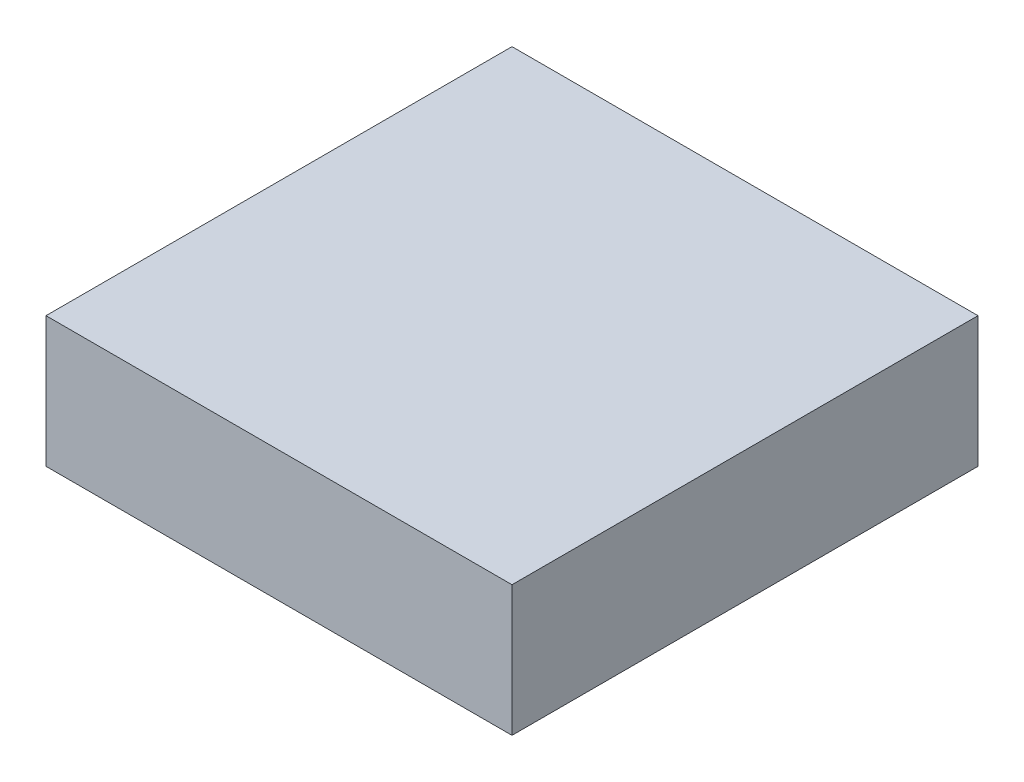
ISO-10303-21;
HEADER;
FILE_DESCRIPTION(('STEP AP214'),'2;1');
FILE_NAME('part.step','',(''),(''),'','','');
FILE_SCHEMA(('AUTOMOTIVE_DESIGN { 1 0 10303 214 1 1 1 1 }'));
ENDSEC;
DATA;
#1=APPLICATION_CONTEXT('core data for automotive mechanical design processes');
#2=APPLICATION_PROTOCOL_DEFINITION('international standard','automotive_design',2000,#1);
#3=PRODUCT_CONTEXT('',#1,'mechanical');
#4=PRODUCT('Part','Part','',(#3));
#5=PRODUCT_RELATED_PRODUCT_CATEGORY('part','',(#4));
#6=PRODUCT_DEFINITION_FORMATION('','',#4);
#7=PRODUCT_DEFINITION_CONTEXT('part definition',#1,'design');
#8=PRODUCT_DEFINITION('design','',#6,#7);
#9=PRODUCT_DEFINITION_SHAPE('','',#8);
#10=(LENGTH_UNIT() NAMED_UNIT(*) SI_UNIT(.MILLI.,.METRE.));
#11=(NAMED_UNIT(*) PLANE_ANGLE_UNIT() SI_UNIT($,.RADIAN.));
#12=(NAMED_UNIT(*) SI_UNIT($,.STERADIAN.) SOLID_ANGLE_UNIT());
#13=UNCERTAINTY_MEASURE_WITH_UNIT(LENGTH_MEASURE(1.E-05),#10,'distance_accuracy_value','');
#14=(GEOMETRIC_REPRESENTATION_CONTEXT(3) GLOBAL_UNCERTAINTY_ASSIGNED_CONTEXT((#13)) GLOBAL_UNIT_ASSIGNED_CONTEXT((#10,
#11,#12)) REPRESENTATION_CONTEXT('',''));
#15=CARTESIAN_POINT('',(0.,0.,0.));
#16=DIRECTION('',(0.,0.,1.));
#17=DIRECTION('',(1.,0.,0.));
#18=AXIS2_PLACEMENT_3D('',#15,#16,#17);
#19=CARTESIAN_POINT('',(-22.5,12.6,-22.5));
#20=DIRECTION('',(1.,0.,0.));
#21=DIRECTION('',(0.,0.,-1.));
#22=AXIS2_PLACEMENT_3D('',#19,#20,#21);
#23=PLANE('',#22);
#24=DIRECTION('',(0.,0.,1.));
#25=VECTOR('',#24,1.);
#26=CARTESIAN_POINT('',(-22.5,0.,-22.5));
#27=LINE('',#26,#25);
#28=CARTESIAN_POINT('',(-22.5,0.,-22.5));
#29=VERTEX_POINT('',#28);
#30=CARTESIAN_POINT('',(-22.5,0.,22.5));
#31=VERTEX_POINT('',#30);
#32=EDGE_CURVE('E96',#29,#31,#27,.T.);
#33=ORIENTED_EDGE('',*,*,#32,.T.);
#34=DIRECTION('',(0.,-1.,0.));
#35=VECTOR('',#34,1.);
#36=CARTESIAN_POINT('',(-22.5,12.6,22.5));
#37=LINE('',#36,#35);
#38=CARTESIAN_POINT('',(-22.5,12.6,22.5));
#39=VERTEX_POINT('',#38);
#40=EDGE_CURVE('E11',#39,#31,#37,.T.);
#41=ORIENTED_EDGE('',*,*,#40,.F.);
#42=DIRECTION('',(0.,0.,1.));
#43=VECTOR('',#42,1.);
#44=CARTESIAN_POINT('',(-22.5,12.6,-22.5));
#45=LINE('',#44,#43);
#46=CARTESIAN_POINT('',(-22.5,12.6,-22.5));
#47=VERTEX_POINT('',#46);
#48=EDGE_CURVE('E84',#47,#39,#45,.T.);
#49=ORIENTED_EDGE('',*,*,#48,.F.);
#50=DIRECTION('',(0.,-1.,0.));
#51=VECTOR('',#50,1.);
#52=CARTESIAN_POINT('',(-22.5,12.6,-22.5));
#53=LINE('',#52,#51);
#54=EDGE_CURVE('E92',#47,#29,#53,.T.);
#55=ORIENTED_EDGE('',*,*,#54,.T.);
#56=EDGE_LOOP('',(#33,#41,#49,#55));
#57=FACE_BOUND('',#56,.T.);
#58=ADVANCED_FACE('F33',(#57),#23,.F.);
#59=CARTESIAN_POINT('',(-22.5,12.6,22.5));
#60=DIRECTION('',(0.,0.,-1.));
#61=DIRECTION('',(-1.,0.,0.));
#62=AXIS2_PLACEMENT_3D('',#59,#60,#61);
#63=PLANE('',#62);
#64=DIRECTION('',(1.,0.,0.));
#65=VECTOR('',#64,1.);
#66=CARTESIAN_POINT('',(-22.5,0.,22.5));
#67=LINE('',#66,#65);
#68=CARTESIAN_POINT('',(22.5,0.,22.5));
#69=VERTEX_POINT('',#68);
#70=EDGE_CURVE('E88',#31,#69,#67,.T.);
#71=ORIENTED_EDGE('',*,*,#70,.T.);
#72=DIRECTION('',(0.,-1.,0.));
#73=VECTOR('',#72,1.);
#74=CARTESIAN_POINT('',(22.5,12.6,22.5));
#75=LINE('',#74,#73);
#76=CARTESIAN_POINT('',(22.5,12.6,22.5));
#77=VERTEX_POINT('',#76);
#78=EDGE_CURVE('E41',#77,#69,#75,.T.);
#79=ORIENTED_EDGE('',*,*,#78,.F.);
#80=DIRECTION('',(1.,0.,0.));
#81=VECTOR('',#80,1.);
#82=CARTESIAN_POINT('',(-22.5,12.6,22.5));
#83=LINE('',#82,#81);
#84=EDGE_CURVE('E79',#39,#77,#83,.T.);
#85=ORIENTED_EDGE('',*,*,#84,.F.);
#86=ORIENTED_EDGE('',*,*,#40,.T.);
#87=EDGE_LOOP('',(#71,#79,#85,#86));
#88=FACE_BOUND('',#87,.T.);
#89=ADVANCED_FACE('F87',(#88),#63,.F.);
#90=CARTESIAN_POINT('',(22.5,12.6,-22.5));
#91=DIRECTION('',(-1.,0.,0.));
#92=DIRECTION('',(0.,0.,1.));
#93=AXIS2_PLACEMENT_3D('',#90,#91,#92);
#94=PLANE('',#93);
#95=DIRECTION('',(0.,0.,-1.));
#96=VECTOR('',#95,1.);
#97=CARTESIAN_POINT('',(22.5,0.,-22.5));
#98=LINE('',#97,#96);
#99=CARTESIAN_POINT('',(22.5,0.,-22.5));
#100=VERTEX_POINT('',#99);
#101=EDGE_CURVE('E66',#69,#100,#98,.T.);
#102=ORIENTED_EDGE('',*,*,#101,.T.);
#103=DIRECTION('',(0.,-1.,0.));
#104=VECTOR('',#103,1.);
#105=CARTESIAN_POINT('',(22.5,12.6,-22.5));
#106=LINE('',#105,#104);
#107=CARTESIAN_POINT('',(22.5,12.6,-22.5));
#108=VERTEX_POINT('',#107);
#109=EDGE_CURVE('E89',#108,#100,#106,.T.);
#110=ORIENTED_EDGE('',*,*,#109,.F.);
#111=DIRECTION('',(0.,0.,-1.));
#112=VECTOR('',#111,1.);
#113=CARTESIAN_POINT('',(22.5,12.6,-22.5));
#114=LINE('',#113,#112);
#115=EDGE_CURVE('E82',#77,#108,#114,.T.);
#116=ORIENTED_EDGE('',*,*,#115,.F.);
#117=ORIENTED_EDGE('',*,*,#78,.T.);
#118=EDGE_LOOP('',(#102,#110,#116,#117));
#119=FACE_BOUND('',#118,.T.);
#120=ADVANCED_FACE('F90',(#119),#94,.F.);
#121=CARTESIAN_POINT('',(-22.5,12.6,-22.5));
#122=DIRECTION('',(0.,0.,1.));
#123=DIRECTION('',(1.,0.,0.));
#124=AXIS2_PLACEMENT_3D('',#121,#122,#123);
#125=PLANE('',#124);
#126=DIRECTION('',(-1.,0.,0.));
#127=VECTOR('',#126,1.);
#128=CARTESIAN_POINT('',(-22.5,0.,-22.5));
#129=LINE('',#128,#127);
#130=EDGE_CURVE('E72',#100,#29,#129,.T.);
#131=ORIENTED_EDGE('',*,*,#130,.T.);
#132=ORIENTED_EDGE('',*,*,#54,.F.);
#133=DIRECTION('',(-1.,0.,0.));
#134=VECTOR('',#133,1.);
#135=CARTESIAN_POINT('',(-22.5,12.6,-22.5));
#136=LINE('',#135,#134);
#137=EDGE_CURVE('E49',#108,#47,#136,.T.);
#138=ORIENTED_EDGE('',*,*,#137,.F.);
#139=ORIENTED_EDGE('',*,*,#109,.T.);
#140=EDGE_LOOP('',(#131,#132,#138,#139));
#141=FACE_BOUND('',#140,.T.);
#142=ADVANCED_FACE('F103',(#141),#125,.F.);
#143=CARTESIAN_POINT('',(0.,12.6,0.));
#144=DIRECTION('',(0.,1.,0.));
#145=DIRECTION('',(0.,0.,1.));
#146=AXIS2_PLACEMENT_3D('',#143,#144,#145);
#147=PLANE('',#146);
#148=ORIENTED_EDGE('',*,*,#48,.T.);
#149=ORIENTED_EDGE('',*,*,#84,.T.);
#150=ORIENTED_EDGE('',*,*,#115,.T.);
#151=ORIENTED_EDGE('',*,*,#137,.T.);
#152=EDGE_LOOP('',(#148,#149,#150,#151));
#153=FACE_BOUND('',#152,.T.);
#154=ADVANCED_FACE('F80',(#153),#147,.T.);
#155=CARTESIAN_POINT('',(0.,0.,0.));
#156=DIRECTION('',(0.,1.,0.));
#157=DIRECTION('',(0.,0.,1.));
#158=AXIS2_PLACEMENT_3D('',#155,#156,#157);
#159=PLANE('',#158);
#160=ORIENTED_EDGE('',*,*,#32,.F.);
#161=ORIENTED_EDGE('',*,*,#130,.F.);
#162=ORIENTED_EDGE('',*,*,#101,.F.);
#163=ORIENTED_EDGE('',*,*,#70,.F.);
#164=EDGE_LOOP('',(#160,#161,#162,#163));
#165=FACE_BOUND('',#164,.T.);
#166=ADVANCED_FACE('F106',(#165),#159,.F.);
#167=CLOSED_SHELL('',(#58,#89,#120,#142,#154,#166));
#168=MANIFOLD_SOLID_BREP('B2',#167);
#169=ADVANCED_BREP_SHAPE_REPRESENTATION('',(#18,#168),#14);
#170=SHAPE_DEFINITION_REPRESENTATION(#9,#169);
ENDSEC;
END-ISO-10303-21;
